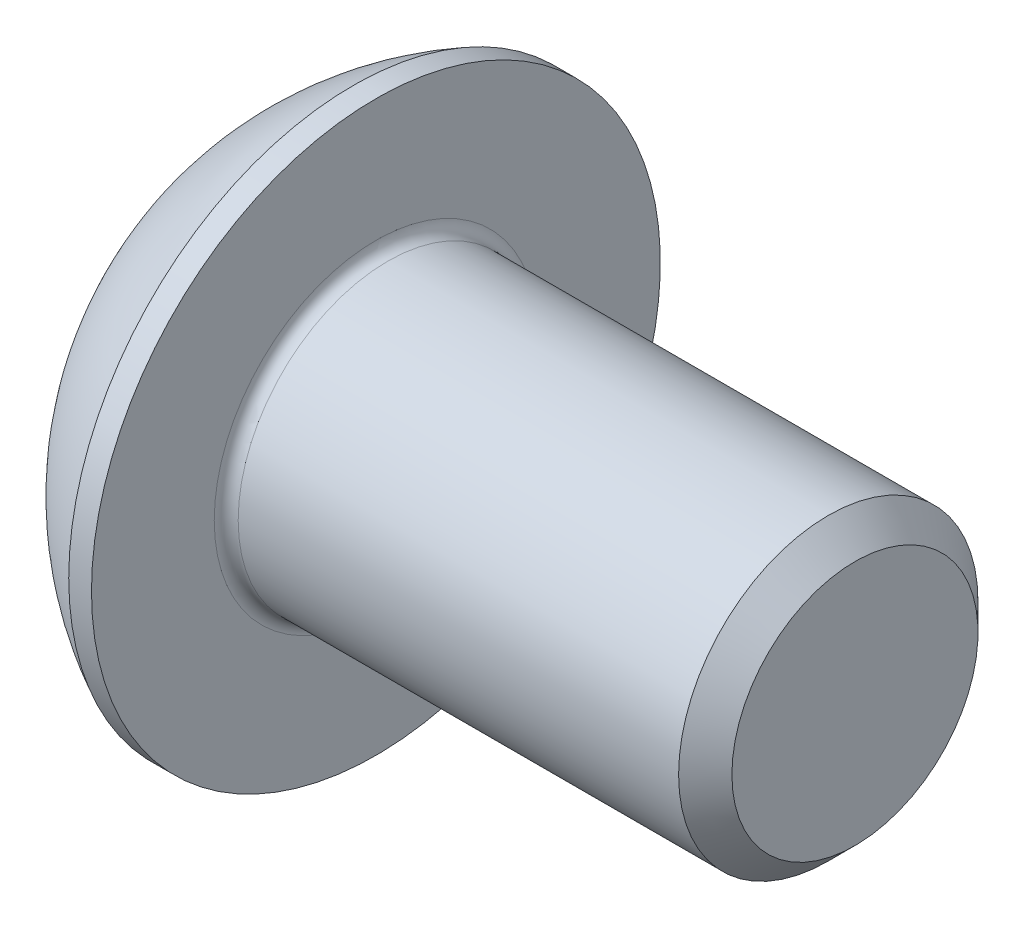
ISO-10303-21;
HEADER;
FILE_DESCRIPTION(('STEP AP214'),'2;1');
FILE_NAME('part.step','',(''),(''),'','','');
FILE_SCHEMA(('AUTOMOTIVE_DESIGN { 1 0 10303 214 1 1 1 1 }'));
ENDSEC;
DATA;
#1=APPLICATION_CONTEXT('core data for automotive mechanical design processes');
#2=APPLICATION_PROTOCOL_DEFINITION('international standard','automotive_design',2000,#1);
#3=PRODUCT_CONTEXT('',#1,'mechanical');
#4=PRODUCT('Part','Part','',(#3));
#5=PRODUCT_RELATED_PRODUCT_CATEGORY('part','',(#4));
#6=PRODUCT_DEFINITION_FORMATION('','',#4);
#7=PRODUCT_DEFINITION_CONTEXT('part definition',#1,'design');
#8=PRODUCT_DEFINITION('design','',#6,#7);
#9=PRODUCT_DEFINITION_SHAPE('','',#8);
#10=(LENGTH_UNIT() NAMED_UNIT(*) SI_UNIT(.MILLI.,.METRE.));
#11=(NAMED_UNIT(*) PLANE_ANGLE_UNIT() SI_UNIT($,.RADIAN.));
#12=(NAMED_UNIT(*) SI_UNIT($,.STERADIAN.) SOLID_ANGLE_UNIT());
#13=UNCERTAINTY_MEASURE_WITH_UNIT(LENGTH_MEASURE(1.E-05),#10,'distance_accuracy_value','');
#14=(GEOMETRIC_REPRESENTATION_CONTEXT(3) GLOBAL_UNCERTAINTY_ASSIGNED_CONTEXT((#13)) GLOBAL_UNIT_ASSIGNED_CONTEXT((#10,
#11,#12)) REPRESENTATION_CONTEXT('',''));
#15=CARTESIAN_POINT('',(0.,0.,0.));
#16=DIRECTION('',(0.,0.,1.));
#17=DIRECTION('',(1.,0.,0.));
#18=AXIS2_PLACEMENT_3D('',#15,#16,#17);
#19=CARTESIAN_POINT('',(0.,0.,0.));
#20=DIRECTION('',(-1.,0.,0.));
#21=DIRECTION('',(0.,0.,1.));
#22=AXIS2_PLACEMENT_3D('',#19,#20,#21);
#23=PLANE('',#22);
#24=CARTESIAN_POINT('',(0.,0.,0.));
#25=DIRECTION('',(-1.,0.,0.));
#26=DIRECTION('',(0.,0.,1.));
#27=AXIS2_PLACEMENT_3D('',#24,#25,#26);
#28=CIRCLE('',#27,2.375);
#29=CARTESIAN_POINT('',(0.,0.,2.375));
#30=VERTEX_POINT('',#29);
#31=EDGE_CURVE('E161',#30,#30,#28,.T.);
#32=ORIENTED_EDGE('',*,*,#31,.T.);
#33=EDGE_LOOP('',(#32));
#34=FACE_BOUND('',#33,.T.);
#35=DIRECTION('',(0.,-1.,0.));
#36=VECTOR('',#35,1.);
#37=CARTESIAN_POINT('',(0.,-0.866025403784438,1.5));
#38=LINE('',#37,#36);
#39=CARTESIAN_POINT('',(0.,0.866025403784439,1.5));
#40=VERTEX_POINT('',#39);
#41=CARTESIAN_POINT('',(0.,-0.866025403784438,1.5));
#42=VERTEX_POINT('',#41);
#43=EDGE_CURVE('E51',#40,#42,#38,.T.);
#44=ORIENTED_EDGE('',*,*,#43,.T.);
#45=DIRECTION('',(0.,-0.5,-0.866025403784439));
#46=VECTOR('',#45,1.);
#47=CARTESIAN_POINT('',(0.,-1.73205080756888,0.));
#48=LINE('',#47,#46);
#49=CARTESIAN_POINT('',(0.,-1.73205080756888,0.));
#50=VERTEX_POINT('',#49);
#51=EDGE_CURVE('E254',#42,#50,#48,.T.);
#52=ORIENTED_EDGE('',*,*,#51,.T.);
#53=DIRECTION('',(0.,0.5,-0.866025403784439));
#54=VECTOR('',#53,1.);
#55=CARTESIAN_POINT('',(0.,-0.866025403784438,-1.5));
#56=LINE('',#55,#54);
#57=CARTESIAN_POINT('',(0.,-0.866025403784438,-1.5));
#58=VERTEX_POINT('',#57);
#59=EDGE_CURVE('E136',#50,#58,#56,.T.);
#60=ORIENTED_EDGE('',*,*,#59,.T.);
#61=DIRECTION('',(0.,1.,0.));
#62=VECTOR('',#61,1.);
#63=CARTESIAN_POINT('',(0.,0.866025403784439,-1.5));
#64=LINE('',#63,#62);
#65=CARTESIAN_POINT('',(0.,0.866025403784439,-1.5));
#66=VERTEX_POINT('',#65);
#67=EDGE_CURVE('E257',#58,#66,#64,.T.);
#68=ORIENTED_EDGE('',*,*,#67,.T.);
#69=DIRECTION('',(0.,0.5,0.866025403784439));
#70=VECTOR('',#69,1.);
#71=CARTESIAN_POINT('',(0.,1.73205080756888,0.));
#72=LINE('',#71,#70);
#73=CARTESIAN_POINT('',(0.,1.73205080756888,0.));
#74=VERTEX_POINT('',#73);
#75=EDGE_CURVE('E259',#66,#74,#72,.T.);
#76=ORIENTED_EDGE('',*,*,#75,.T.);
#77=DIRECTION('',(0.,-0.5,0.866025403784439));
#78=VECTOR('',#77,1.);
#79=CARTESIAN_POINT('',(0.,0.866025403784439,1.5));
#80=LINE('',#79,#78);
#81=EDGE_CURVE('E261',#74,#40,#80,.T.);
#82=ORIENTED_EDGE('',*,*,#81,.T.);
#83=EDGE_LOOP('',(#44,#52,#60,#68,#76,#82));
#84=FACE_BOUND('',#83,.T.);
#85=ADVANCED_FACE('F36',(#34,#84),#23,.T.);
#86=CARTESIAN_POINT('',(4.75501582278481,0.,0.));
#87=DIRECTION('',(-1.,0.,0.));
#88=DIRECTION('',(0.,1.,0.));
#89=AXIS2_PLACEMENT_3D('',#86,#87,#88);
#90=SPHERICAL_SURFACE('',#89,5.3151482081814);
#91=CARTESIAN_POINT('',(2.37,0.,0.));
#92=DIRECTION('',(-1.,0.,0.));
#93=DIRECTION('',(0.,0.,1.));
#94=AXIS2_PLACEMENT_3D('',#91,#92,#93);
#95=CIRCLE('',#94,4.75);
#96=CARTESIAN_POINT('',(2.37,0.,4.75));
#97=VERTEX_POINT('',#96);
#98=EDGE_CURVE('E158',#97,#97,#95,.T.);
#99=ORIENTED_EDGE('',*,*,#98,.T.);
#100=EDGE_LOOP('',(#99));
#101=FACE_BOUND('',#100,.T.);
#102=ORIENTED_EDGE('',*,*,#31,.F.);
#103=EDGE_LOOP('',(#102));
#104=FACE_BOUND('',#103,.T.);
#105=ADVANCED_FACE('F182',(#101,#104),#90,.T.);
#106=CARTESIAN_POINT('',(0.,0.,0.));
#107=DIRECTION('',(-1.,0.,0.));
#108=DIRECTION('',(0.,0.,1.));
#109=AXIS2_PLACEMENT_3D('',#106,#107,#108);
#110=CYLINDRICAL_SURFACE('',#109,4.75);
#111=ORIENTED_EDGE('',*,*,#98,.F.);
#112=EDGE_LOOP('',(#111));
#113=FACE_BOUND('',#112,.T.);
#114=CARTESIAN_POINT('',(2.75,0.,0.));
#115=DIRECTION('',(-1.,0.,0.));
#116=DIRECTION('',(0.,0.,1.));
#117=AXIS2_PLACEMENT_3D('',#114,#115,#116);
#118=CIRCLE('',#117,4.75);
#119=CARTESIAN_POINT('',(2.75,0.,4.75));
#120=VERTEX_POINT('',#119);
#121=EDGE_CURVE('E155',#120,#120,#118,.T.);
#122=ORIENTED_EDGE('',*,*,#121,.T.);
#123=EDGE_LOOP('',(#122));
#124=FACE_BOUND('',#123,.T.);
#125=ADVANCED_FACE('F187',(#113,#124),#110,.T.);
#126=CARTESIAN_POINT('',(2.75,2.5,0.));
#127=DIRECTION('',(-1.,0.,0.));
#128=DIRECTION('',(0.,0.,1.));
#129=AXIS2_PLACEMENT_3D('',#126,#127,#128);
#130=PLANE('',#129);
#131=CARTESIAN_POINT('',(2.75,0.,0.));
#132=DIRECTION('',(-1.,0.,0.));
#133=DIRECTION('',(0.,0.,1.));
#134=AXIS2_PLACEMENT_3D('',#131,#132,#133);
#135=CIRCLE('',#134,2.7);
#136=CARTESIAN_POINT('',(2.75,0.,2.7));
#137=VERTEX_POINT('',#136);
#138=EDGE_CURVE('E44',#137,#137,#135,.T.);
#139=ORIENTED_EDGE('',*,*,#138,.T.);
#140=EDGE_LOOP('',(#139));
#141=FACE_BOUND('',#140,.T.);
#142=ORIENTED_EDGE('',*,*,#121,.F.);
#143=EDGE_LOOP('',(#142));
#144=FACE_BOUND('',#143,.T.);
#145=ADVANCED_FACE('F166',(#141,#144),#130,.F.);
#146=CARTESIAN_POINT('',(0.,0.,0.));
#147=DIRECTION('',(-1.,0.,0.));
#148=DIRECTION('',(0.,0.,1.));
#149=AXIS2_PLACEMENT_3D('',#146,#147,#148);
#150=CYLINDRICAL_SURFACE('',#149,2.5);
#151=CARTESIAN_POINT('',(2.95,0.,0.));
#152=DIRECTION('',(-1.,0.,0.));
#153=DIRECTION('',(0.,0.,1.));
#154=AXIS2_PLACEMENT_3D('',#151,#152,#153);
#155=CIRCLE('',#154,2.5);
#156=CARTESIAN_POINT('',(2.95,0.,2.5));
#157=VERTEX_POINT('',#156);
#158=EDGE_CURVE('E11',#157,#157,#155,.F.);
#159=ORIENTED_EDGE('',*,*,#158,.T.);
#160=EDGE_LOOP('',(#159));
#161=FACE_BOUND('',#160,.T.);
#162=CARTESIAN_POINT('',(10.305,0.,0.));
#163=DIRECTION('',(-1.,0.,0.));
#164=DIRECTION('',(0.,0.,1.));
#165=AXIS2_PLACEMENT_3D('',#162,#163,#164);
#166=CIRCLE('',#165,2.5);
#167=CARTESIAN_POINT('',(10.305,0.,2.5));
#168=VERTEX_POINT('',#167);
#169=EDGE_CURVE('E152',#168,#168,#166,.T.);
#170=ORIENTED_EDGE('',*,*,#169,.T.);
#171=EDGE_LOOP('',(#170));
#172=FACE_BOUND('',#171,.T.);
#173=ADVANCED_FACE('F196',(#161,#172),#150,.T.);
#174=CARTESIAN_POINT('',(10.75,0.,0.));
#175=DIRECTION('',(-1.,0.,0.));
#176=DIRECTION('',(0.,0.,1.));
#177=AXIS2_PLACEMENT_3D('',#174,#175,#176);
#178=CONICAL_SURFACE('',#177,2.055,0.785398163397451);
#179=ORIENTED_EDGE('',*,*,#169,.F.);
#180=EDGE_LOOP('',(#179));
#181=FACE_BOUND('',#180,.T.);
#182=CARTESIAN_POINT('',(10.75,0.,0.));
#183=DIRECTION('',(-1.,0.,0.));
#184=DIRECTION('',(0.,0.,1.));
#185=AXIS2_PLACEMENT_3D('',#182,#183,#184);
#186=CIRCLE('',#185,2.055);
#187=CARTESIAN_POINT('',(10.75,0.,2.055));
#188=VERTEX_POINT('',#187);
#189=EDGE_CURVE('E148',#188,#188,#186,.T.);
#190=ORIENTED_EDGE('',*,*,#189,.T.);
#191=EDGE_LOOP('',(#190));
#192=FACE_BOUND('',#191,.T.);
#193=ADVANCED_FACE('F177',(#181,#192),#178,.T.);
#194=CARTESIAN_POINT('',(10.75,0.,0.));
#195=DIRECTION('',(-1.,0.,0.));
#196=DIRECTION('',(0.,0.,1.));
#197=AXIS2_PLACEMENT_3D('',#194,#195,#196);
#198=PLANE('',#197);
#199=ORIENTED_EDGE('',*,*,#189,.F.);
#200=EDGE_LOOP('',(#199));
#201=FACE_BOUND('',#200,.T.);
#202=ADVANCED_FACE('F170',(#201),#198,.F.);
#203=CARTESIAN_POINT('',(2.95,0.,0.));
#204=DIRECTION('',(-1.,0.,0.));
#205=DIRECTION('',(0.,0.,1.));
#206=AXIS2_PLACEMENT_3D('',#203,#204,#205);
#207=TOROIDAL_SURFACE('',#206,2.7,0.2);
#208=ORIENTED_EDGE('',*,*,#158,.F.);
#209=EDGE_LOOP('',(#208));
#210=FACE_BOUND('',#209,.T.);
#211=ORIENTED_EDGE('',*,*,#138,.F.);
#212=EDGE_LOOP('',(#211));
#213=FACE_BOUND('',#212,.T.);
#214=ADVANCED_FACE('F38',(#210,#213),#207,.F.);
#215=CARTESIAN_POINT('',(1.56,-1.73205080756888,0.));
#216=DIRECTION('',(0.,0.866025403784439,-0.5));
#217=DIRECTION('',(0.,0.5,0.866025403784439));
#218=AXIS2_PLACEMENT_3D('',#215,#216,#217);
#219=PLANE('',#218);
#220=DIRECTION('',(0.,-0.5,-0.866025403784439));
#221=VECTOR('',#220,1.);
#222=CARTESIAN_POINT('',(1.56,-1.73205080756888,0.));
#223=LINE('',#222,#221);
#224=CARTESIAN_POINT('',(1.56,-0.866025403784438,1.5));
#225=VERTEX_POINT('',#224);
#226=CARTESIAN_POINT('',(1.56,-1.29903810567666,0.749999999999999));
#227=VERTEX_POINT('',#226);
#228=EDGE_CURVE('E119',#225,#227,#223,.T.);
#229=ORIENTED_EDGE('',*,*,#228,.T.);
#230=CARTESIAN_POINT('',(1.56,-1.73205080756888,0.));
#231=VERTEX_POINT('',#230);
#232=EDGE_CURVE('E112',#227,#231,#223,.T.);
#233=ORIENTED_EDGE('',*,*,#232,.T.);
#234=DIRECTION('',(-1.,0.,0.));
#235=VECTOR('',#234,1.);
#236=CARTESIAN_POINT('',(1.56,-1.73205080756888,0.));
#237=LINE('',#236,#235);
#238=EDGE_CURVE('E116',#231,#50,#237,.T.);
#239=ORIENTED_EDGE('',*,*,#238,.T.);
#240=ORIENTED_EDGE('',*,*,#51,.F.);
#241=DIRECTION('',(-1.,0.,0.));
#242=VECTOR('',#241,1.);
#243=CARTESIAN_POINT('',(1.56,-0.866025403784438,1.5));
#244=LINE('',#243,#242);
#245=EDGE_CURVE('E244',#225,#42,#244,.T.);
#246=ORIENTED_EDGE('',*,*,#245,.F.);
#247=EDGE_LOOP('',(#229,#233,#239,#240,#246));
#248=FACE_BOUND('',#247,.T.);
#249=ADVANCED_FACE('F114',(#248),#219,.T.);
#250=CARTESIAN_POINT('',(1.56,-0.866025403784438,-1.5));
#251=DIRECTION('',(0.,0.866025403784439,0.5));
#252=DIRECTION('',(0.,-0.5,0.866025403784439));
#253=AXIS2_PLACEMENT_3D('',#250,#251,#252);
#254=PLANE('',#253);
#255=DIRECTION('',(0.,0.5,-0.866025403784439));
#256=VECTOR('',#255,1.);
#257=CARTESIAN_POINT('',(1.56,-0.866025403784438,-1.5));
#258=LINE('',#257,#256);
#259=CARTESIAN_POINT('',(1.56,-1.29903810567666,-0.749999999999999));
#260=VERTEX_POINT('',#259);
#261=EDGE_CURVE('E124',#231,#260,#258,.T.);
#262=ORIENTED_EDGE('',*,*,#261,.T.);
#263=CARTESIAN_POINT('',(1.56,-0.866025403784438,-1.5));
#264=VERTEX_POINT('',#263);
#265=EDGE_CURVE('E131',#260,#264,#258,.T.);
#266=ORIENTED_EDGE('',*,*,#265,.T.);
#267=DIRECTION('',(-1.,0.,0.));
#268=VECTOR('',#267,1.);
#269=CARTESIAN_POINT('',(1.56,-0.866025403784438,-1.5));
#270=LINE('',#269,#268);
#271=EDGE_CURVE('E138',#264,#58,#270,.T.);
#272=ORIENTED_EDGE('',*,*,#271,.T.);
#273=ORIENTED_EDGE('',*,*,#59,.F.);
#274=ORIENTED_EDGE('',*,*,#238,.F.);
#275=EDGE_LOOP('',(#262,#266,#272,#273,#274));
#276=FACE_BOUND('',#275,.T.);
#277=ADVANCED_FACE('F134',(#276),#254,.T.);
#278=CARTESIAN_POINT('',(1.56,0.866025403784439,-1.5));
#279=DIRECTION('',(0.,0.,1.));
#280=DIRECTION('',(1.,0.,0.));
#281=AXIS2_PLACEMENT_3D('',#278,#279,#280);
#282=PLANE('',#281);
#283=DIRECTION('',(0.,1.,0.));
#284=VECTOR('',#283,1.);
#285=CARTESIAN_POINT('',(1.56,0.866025403784439,-1.5));
#286=LINE('',#285,#284);
#287=CARTESIAN_POINT('',(1.56,0.,-1.5));
#288=VERTEX_POINT('',#287);
#289=EDGE_CURVE('E280',#264,#288,#286,.T.);
#290=ORIENTED_EDGE('',*,*,#289,.T.);
#291=CARTESIAN_POINT('',(1.56,0.866025403784439,-1.5));
#292=VERTEX_POINT('',#291);
#293=EDGE_CURVE('E130',#288,#292,#286,.T.);
#294=ORIENTED_EDGE('',*,*,#293,.T.);
#295=DIRECTION('',(-1.,0.,0.));
#296=VECTOR('',#295,1.);
#297=CARTESIAN_POINT('',(1.56,0.866025403784439,-1.5));
#298=LINE('',#297,#296);
#299=EDGE_CURVE('E143',#292,#66,#298,.T.);
#300=ORIENTED_EDGE('',*,*,#299,.T.);
#301=ORIENTED_EDGE('',*,*,#67,.F.);
#302=ORIENTED_EDGE('',*,*,#271,.F.);
#303=EDGE_LOOP('',(#290,#294,#300,#301,#302));
#304=FACE_BOUND('',#303,.T.);
#305=ADVANCED_FACE('F210',(#304),#282,.T.);
#306=CARTESIAN_POINT('',(1.56,1.73205080756888,0.));
#307=DIRECTION('',(0.,-0.866025403784438,0.5));
#308=DIRECTION('',(0.,-0.5,-0.866025403784439));
#309=AXIS2_PLACEMENT_3D('',#306,#307,#308);
#310=PLANE('',#309);
#311=DIRECTION('',(0.,0.5,0.866025403784439));
#312=VECTOR('',#311,1.);
#313=CARTESIAN_POINT('',(1.56,1.73205080756888,0.));
#314=LINE('',#313,#312);
#315=CARTESIAN_POINT('',(1.56,1.29903810567666,-0.750000000000001));
#316=VERTEX_POINT('',#315);
#317=EDGE_CURVE('E286',#292,#316,#314,.T.);
#318=ORIENTED_EDGE('',*,*,#317,.T.);
#319=CARTESIAN_POINT('',(1.56,1.73205080756888,0.));
#320=VERTEX_POINT('',#319);
#321=EDGE_CURVE('E284',#316,#320,#314,.T.);
#322=ORIENTED_EDGE('',*,*,#321,.T.);
#323=DIRECTION('',(-1.,0.,0.));
#324=VECTOR('',#323,1.);
#325=CARTESIAN_POINT('',(1.56,1.73205080756888,0.));
#326=LINE('',#325,#324);
#327=EDGE_CURVE('E266',#320,#74,#326,.T.);
#328=ORIENTED_EDGE('',*,*,#327,.T.);
#329=ORIENTED_EDGE('',*,*,#75,.F.);
#330=ORIENTED_EDGE('',*,*,#299,.F.);
#331=EDGE_LOOP('',(#318,#322,#328,#329,#330));
#332=FACE_BOUND('',#331,.T.);
#333=ADVANCED_FACE('F213',(#332),#310,.T.);
#334=CARTESIAN_POINT('',(1.56,0.866025403784439,1.5));
#335=DIRECTION('',(0.,-0.866025403784439,-0.5));
#336=DIRECTION('',(0.,0.5,-0.866025403784439));
#337=AXIS2_PLACEMENT_3D('',#334,#335,#336);
#338=PLANE('',#337);
#339=DIRECTION('',(0.,-0.5,0.866025403784439));
#340=VECTOR('',#339,1.);
#341=CARTESIAN_POINT('',(1.56,0.866025403784439,1.5));
#342=LINE('',#341,#340);
#343=CARTESIAN_POINT('',(1.56,1.29903810567666,0.75));
#344=VERTEX_POINT('',#343);
#345=EDGE_CURVE('E250',#320,#344,#342,.T.);
#346=ORIENTED_EDGE('',*,*,#345,.T.);
#347=CARTESIAN_POINT('',(1.56,0.866025403784439,1.5));
#348=VERTEX_POINT('',#347);
#349=EDGE_CURVE('E242',#344,#348,#342,.T.);
#350=ORIENTED_EDGE('',*,*,#349,.T.);
#351=DIRECTION('',(-1.,0.,0.));
#352=VECTOR('',#351,1.);
#353=CARTESIAN_POINT('',(1.56,0.866025403784439,1.5));
#354=LINE('',#353,#352);
#355=EDGE_CURVE('E248',#348,#40,#354,.T.);
#356=ORIENTED_EDGE('',*,*,#355,.T.);
#357=ORIENTED_EDGE('',*,*,#81,.F.);
#358=ORIENTED_EDGE('',*,*,#327,.F.);
#359=EDGE_LOOP('',(#346,#350,#356,#357,#358));
#360=FACE_BOUND('',#359,.T.);
#361=ADVANCED_FACE('F217',(#360),#338,.T.);
#362=CARTESIAN_POINT('',(1.56,-0.866025403784438,1.5));
#363=DIRECTION('',(0.,0.,-1.));
#364=DIRECTION('',(-1.,0.,0.));
#365=AXIS2_PLACEMENT_3D('',#362,#363,#364);
#366=PLANE('',#365);
#367=DIRECTION('',(0.,-1.,0.));
#368=VECTOR('',#367,1.);
#369=CARTESIAN_POINT('',(1.56,-0.866025403784438,1.5));
#370=LINE('',#369,#368);
#371=CARTESIAN_POINT('',(1.56,0.,1.5));
#372=VERTEX_POINT('',#371);
#373=EDGE_CURVE('E59',#348,#372,#370,.T.);
#374=ORIENTED_EDGE('',*,*,#373,.T.);
#375=EDGE_CURVE('E245',#372,#225,#370,.T.);
#376=ORIENTED_EDGE('',*,*,#375,.T.);
#377=ORIENTED_EDGE('',*,*,#245,.T.);
#378=ORIENTED_EDGE('',*,*,#43,.F.);
#379=ORIENTED_EDGE('',*,*,#355,.F.);
#380=EDGE_LOOP('',(#374,#376,#377,#378,#379));
#381=FACE_BOUND('',#380,.T.);
#382=ADVANCED_FACE('F221',(#381),#366,.T.);
#383=CARTESIAN_POINT('',(1.56,-0.866025403784438,1.5));
#384=DIRECTION('',(-1.,0.,0.));
#385=DIRECTION('',(0.,0.,1.));
#386=AXIS2_PLACEMENT_3D('',#383,#384,#385);
#387=PLANE('',#386);
#388=ORIENTED_EDGE('',*,*,#373,.F.);
#389=ORIENTED_EDGE('',*,*,#349,.F.);
#390=CARTESIAN_POINT('',(1.56,0.,0.));
#391=DIRECTION('',(-1.,0.,0.));
#392=DIRECTION('',(0.,0.,1.));
#393=AXIS2_PLACEMENT_3D('',#390,#391,#392);
#394=CIRCLE('',#393,1.5);
#395=EDGE_CURVE('E142',#372,#344,#394,.T.);
#396=ORIENTED_EDGE('',*,*,#395,.F.);
#397=EDGE_LOOP('',(#388,#389,#396));
#398=FACE_BOUND('',#397,.T.);
#399=ADVANCED_FACE('F225',(#398),#387,.T.);
#400=ORIENTED_EDGE('',*,*,#345,.F.);
#401=ORIENTED_EDGE('',*,*,#321,.F.);
#402=EDGE_CURVE('E149',#344,#316,#394,.T.);
#403=ORIENTED_EDGE('',*,*,#402,.F.);
#404=EDGE_LOOP('',(#400,#401,#403));
#405=FACE_BOUND('',#404,.T.);
#406=ADVANCED_FACE('F233',(#405),#387,.T.);
#407=ORIENTED_EDGE('',*,*,#317,.F.);
#408=ORIENTED_EDGE('',*,*,#293,.F.);
#409=EDGE_CURVE('E291',#316,#288,#394,.T.);
#410=ORIENTED_EDGE('',*,*,#409,.F.);
#411=EDGE_LOOP('',(#407,#408,#410));
#412=FACE_BOUND('',#411,.T.);
#413=ADVANCED_FACE('F238',(#412),#387,.T.);
#414=ORIENTED_EDGE('',*,*,#289,.F.);
#415=ORIENTED_EDGE('',*,*,#265,.F.);
#416=EDGE_CURVE('E283',#288,#260,#394,.T.);
#417=ORIENTED_EDGE('',*,*,#416,.F.);
#418=EDGE_LOOP('',(#414,#415,#417));
#419=FACE_BOUND('',#418,.T.);
#420=ADVANCED_FACE('F231',(#419),#387,.T.);
#421=ORIENTED_EDGE('',*,*,#261,.F.);
#422=ORIENTED_EDGE('',*,*,#232,.F.);
#423=EDGE_CURVE('E126',#260,#227,#394,.T.);
#424=ORIENTED_EDGE('',*,*,#423,.F.);
#425=EDGE_LOOP('',(#421,#422,#424));
#426=FACE_BOUND('',#425,.T.);
#427=ADVANCED_FACE('F125',(#426),#387,.T.);
#428=ORIENTED_EDGE('',*,*,#228,.F.);
#429=ORIENTED_EDGE('',*,*,#375,.F.);
#430=EDGE_CURVE('E137',#227,#372,#394,.T.);
#431=ORIENTED_EDGE('',*,*,#430,.F.);
#432=EDGE_LOOP('',(#428,#429,#431));
#433=FACE_BOUND('',#432,.T.);
#434=ADVANCED_FACE('F205',(#433),#387,.T.);
#435=CARTESIAN_POINT('',(2.42602540378445,0.,0.));
#436=DIRECTION('',(-1.,0.,0.));
#437=DIRECTION('',(0.,0.,1.));
#438=AXIS2_PLACEMENT_3D('',#435,#436,#437);
#439=CONICAL_SURFACE('',#438,0.,1.04719755119659);
#440=ORIENTED_EDGE('',*,*,#395,.T.);
#441=ORIENTED_EDGE('',*,*,#402,.T.);
#442=ORIENTED_EDGE('',*,*,#409,.T.);
#443=ORIENTED_EDGE('',*,*,#416,.T.);
#444=ORIENTED_EDGE('',*,*,#423,.T.);
#445=ORIENTED_EDGE('',*,*,#430,.T.);
#446=EDGE_LOOP('',(#440,#441,#442,#443,#444,#445));
#447=FACE_BOUND('',#446,.T.);
#448=CARTESIAN_POINT('',(2.42602540378445,0.,0.));
#449=VERTEX_POINT('',#448);
#450=VERTEX_LOOP('',#449);
#451=FACE_BOUND('',#450,.T.);
#452=ADVANCED_FACE('F203',(#447,#451),#439,.F.);
#453=CLOSED_SHELL('',(#85,#105,#125,#145,#173,#193,#202,#214,#249,#277,#305,#333,#361,#382,#399,
#406,#413,#420,#427,#434,#452));
#454=MANIFOLD_SOLID_BREP('B2',#453);
#455=ADVANCED_BREP_SHAPE_REPRESENTATION('',(#18,#454),#14);
#456=SHAPE_DEFINITION_REPRESENTATION(#9,#455);
ENDSEC;
END-ISO-10303-21;
